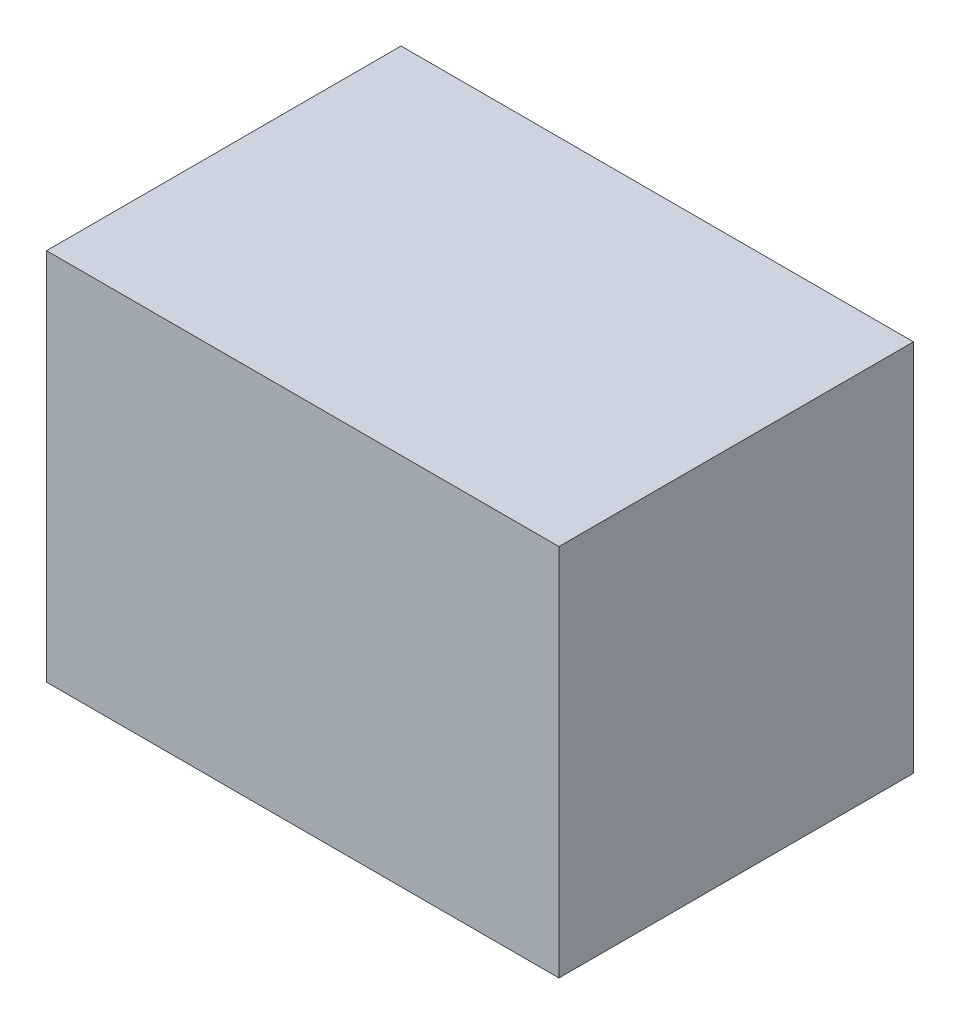
ISO-10303-21;
HEADER;
FILE_DESCRIPTION(('STEP AP214'),'2;1');
FILE_NAME('part.step','',(''),(''),'','','');
FILE_SCHEMA(('AUTOMOTIVE_DESIGN { 1 0 10303 214 1 1 1 1 }'));
ENDSEC;
DATA;
#1=APPLICATION_CONTEXT('core data for automotive mechanical design processes');
#2=APPLICATION_PROTOCOL_DEFINITION('international standard','automotive_design',2000,#1);
#3=PRODUCT_CONTEXT('',#1,'mechanical');
#4=PRODUCT('Part','Part','',(#3));
#5=PRODUCT_RELATED_PRODUCT_CATEGORY('part','',(#4));
#6=PRODUCT_DEFINITION_FORMATION('','',#4);
#7=PRODUCT_DEFINITION_CONTEXT('part definition',#1,'design');
#8=PRODUCT_DEFINITION('design','',#6,#7);
#9=PRODUCT_DEFINITION_SHAPE('','',#8);
#10=(LENGTH_UNIT() NAMED_UNIT(*) SI_UNIT(.MILLI.,.METRE.));
#11=(NAMED_UNIT(*) PLANE_ANGLE_UNIT() SI_UNIT($,.RADIAN.));
#12=(NAMED_UNIT(*) SI_UNIT($,.STERADIAN.) SOLID_ANGLE_UNIT());
#13=UNCERTAINTY_MEASURE_WITH_UNIT(LENGTH_MEASURE(1.E-05),#10,'distance_accuracy_value','');
#14=(GEOMETRIC_REPRESENTATION_CONTEXT(3) GLOBAL_UNCERTAINTY_ASSIGNED_CONTEXT((#13)) GLOBAL_UNIT_ASSIGNED_CONTEXT((#10,
#11,#12)) REPRESENTATION_CONTEXT('',''));
#15=CARTESIAN_POINT('',(0.,0.,0.));
#16=DIRECTION('',(0.,0.,1.));
#17=DIRECTION('',(1.,0.,0.));
#18=AXIS2_PLACEMENT_3D('',#15,#16,#17);
#19=CARTESIAN_POINT('',(24.,35.,16.6045));
#20=DIRECTION('',(-1.,0.,0.));
#21=DIRECTION('',(0.,0.,1.));
#22=AXIS2_PLACEMENT_3D('',#19,#20,#21);
#23=PLANE('',#22);
#24=DIRECTION('',(0.,0.,-1.));
#25=VECTOR('',#24,1.);
#26=CARTESIAN_POINT('',(24.,0.,16.6045));
#27=LINE('',#26,#25);
#28=CARTESIAN_POINT('',(24.,0.,16.6045));
#29=VERTEX_POINT('',#28);
#30=CARTESIAN_POINT('',(24.,0.,-16.6045));
#31=VERTEX_POINT('',#30);
#32=EDGE_CURVE('E106',#29,#31,#27,.T.);
#33=ORIENTED_EDGE('',*,*,#32,.T.);
#34=DIRECTION('',(0.,-1.,0.));
#35=VECTOR('',#34,1.);
#36=CARTESIAN_POINT('',(24.,35.,-16.6045));
#37=LINE('',#36,#35);
#38=CARTESIAN_POINT('',(24.,35.,-16.6045));
#39=VERTEX_POINT('',#38);
#40=EDGE_CURVE('E11',#39,#31,#37,.T.);
#41=ORIENTED_EDGE('',*,*,#40,.F.);
#42=DIRECTION('',(0.,0.,-1.));
#43=VECTOR('',#42,1.);
#44=CARTESIAN_POINT('',(24.,35.,16.6045));
#45=LINE('',#44,#43);
#46=CARTESIAN_POINT('',(24.,35.,16.6045));
#47=VERTEX_POINT('',#46);
#48=EDGE_CURVE('E90',#47,#39,#45,.T.);
#49=ORIENTED_EDGE('',*,*,#48,.F.);
#50=DIRECTION('',(0.,-1.,0.));
#51=VECTOR('',#50,1.);
#52=CARTESIAN_POINT('',(24.,35.,16.6045));
#53=LINE('',#52,#51);
#54=EDGE_CURVE('E102',#47,#29,#53,.T.);
#55=ORIENTED_EDGE('',*,*,#54,.T.);
#56=EDGE_LOOP('',(#33,#41,#49,#55));
#57=FACE_BOUND('',#56,.T.);
#58=ADVANCED_FACE('F38',(#57),#23,.F.);
#59=CARTESIAN_POINT('',(-24.,35.,-16.6045));
#60=DIRECTION('',(0.,0.,1.));
#61=DIRECTION('',(1.,0.,0.));
#62=AXIS2_PLACEMENT_3D('',#59,#60,#61);
#63=PLANE('',#62);
#64=DIRECTION('',(-1.,0.,0.));
#65=VECTOR('',#64,1.);
#66=CARTESIAN_POINT('',(-24.,0.,-16.6045));
#67=LINE('',#66,#65);
#68=CARTESIAN_POINT('',(-24.,0.,-16.6045));
#69=VERTEX_POINT('',#68);
#70=EDGE_CURVE('E95',#31,#69,#67,.T.);
#71=ORIENTED_EDGE('',*,*,#70,.T.);
#72=DIRECTION('',(0.,-1.,0.));
#73=VECTOR('',#72,1.);
#74=CARTESIAN_POINT('',(-24.,35.,-16.6045));
#75=LINE('',#74,#73);
#76=CARTESIAN_POINT('',(-24.,35.,-16.6045));
#77=VERTEX_POINT('',#76);
#78=EDGE_CURVE('E47',#77,#69,#75,.T.);
#79=ORIENTED_EDGE('',*,*,#78,.F.);
#80=DIRECTION('',(-1.,0.,0.));
#81=VECTOR('',#80,1.);
#82=CARTESIAN_POINT('',(-24.,35.,-16.6045));
#83=LINE('',#82,#81);
#84=EDGE_CURVE('E85',#39,#77,#83,.T.);
#85=ORIENTED_EDGE('',*,*,#84,.F.);
#86=ORIENTED_EDGE('',*,*,#40,.T.);
#87=EDGE_LOOP('',(#71,#79,#85,#86));
#88=FACE_BOUND('',#87,.T.);
#89=ADVANCED_FACE('F94',(#88),#63,.F.);
#90=CARTESIAN_POINT('',(-24.,35.,16.6045));
#91=DIRECTION('',(1.,0.,0.));
#92=DIRECTION('',(0.,0.,-1.));
#93=AXIS2_PLACEMENT_3D('',#90,#91,#92);
#94=PLANE('',#93);
#95=DIRECTION('',(0.,0.,1.));
#96=VECTOR('',#95,1.);
#97=CARTESIAN_POINT('',(-24.,0.,16.6045));
#98=LINE('',#97,#96);
#99=CARTESIAN_POINT('',(-24.,0.,16.6045));
#100=VERTEX_POINT('',#99);
#101=EDGE_CURVE('E72',#69,#100,#98,.T.);
#102=ORIENTED_EDGE('',*,*,#101,.T.);
#103=DIRECTION('',(0.,-1.,0.));
#104=VECTOR('',#103,1.);
#105=CARTESIAN_POINT('',(-24.,35.,16.6045));
#106=LINE('',#105,#104);
#107=CARTESIAN_POINT('',(-24.,35.,16.6045));
#108=VERTEX_POINT('',#107);
#109=EDGE_CURVE('E97',#108,#100,#106,.T.);
#110=ORIENTED_EDGE('',*,*,#109,.F.);
#111=DIRECTION('',(0.,0.,1.));
#112=VECTOR('',#111,1.);
#113=CARTESIAN_POINT('',(-24.,35.,16.6045));
#114=LINE('',#113,#112);
#115=EDGE_CURVE('E88',#77,#108,#114,.T.);
#116=ORIENTED_EDGE('',*,*,#115,.F.);
#117=ORIENTED_EDGE('',*,*,#78,.T.);
#118=EDGE_LOOP('',(#102,#110,#116,#117));
#119=FACE_BOUND('',#118,.T.);
#120=ADVANCED_FACE('F98',(#119),#94,.F.);
#121=CARTESIAN_POINT('',(-24.,35.,16.6045));
#122=DIRECTION('',(0.,0.,-1.));
#123=DIRECTION('',(-1.,0.,0.));
#124=AXIS2_PLACEMENT_3D('',#121,#122,#123);
#125=PLANE('',#124);
#126=DIRECTION('',(1.,0.,0.));
#127=VECTOR('',#126,1.);
#128=CARTESIAN_POINT('',(-24.,0.,16.6045));
#129=LINE('',#128,#127);
#130=EDGE_CURVE('E78',#100,#29,#129,.T.);
#131=ORIENTED_EDGE('',*,*,#130,.T.);
#132=ORIENTED_EDGE('',*,*,#54,.F.);
#133=DIRECTION('',(1.,0.,0.));
#134=VECTOR('',#133,1.);
#135=CARTESIAN_POINT('',(-24.,35.,16.6045));
#136=LINE('',#135,#134);
#137=EDGE_CURVE('E55',#108,#47,#136,.T.);
#138=ORIENTED_EDGE('',*,*,#137,.F.);
#139=ORIENTED_EDGE('',*,*,#109,.T.);
#140=EDGE_LOOP('',(#131,#132,#138,#139));
#141=FACE_BOUND('',#140,.T.);
#142=ADVANCED_FACE('F119',(#141),#125,.F.);
#143=CARTESIAN_POINT('',(0.,35.,0.));
#144=DIRECTION('',(0.,-1.,0.));
#145=DIRECTION('',(0.,0.,-1.));
#146=AXIS2_PLACEMENT_3D('',#143,#144,#145);
#147=PLANE('',#146);
#148=ORIENTED_EDGE('',*,*,#48,.T.);
#149=ORIENTED_EDGE('',*,*,#84,.T.);
#150=ORIENTED_EDGE('',*,*,#115,.T.);
#151=ORIENTED_EDGE('',*,*,#137,.T.);
#152=EDGE_LOOP('',(#148,#149,#150,#151));
#153=FACE_BOUND('',#152,.T.);
#154=ADVANCED_FACE('F86',(#153),#147,.F.);
#155=CARTESIAN_POINT('',(0.,0.,0.));
#156=DIRECTION('',(0.,-1.,0.));
#157=DIRECTION('',(0.,0.,-1.));
#158=AXIS2_PLACEMENT_3D('',#155,#156,#157);
#159=PLANE('',#158);
#160=ORIENTED_EDGE('',*,*,#32,.F.);
#161=ORIENTED_EDGE('',*,*,#130,.F.);
#162=ORIENTED_EDGE('',*,*,#101,.F.);
#163=ORIENTED_EDGE('',*,*,#70,.F.);
#164=EDGE_LOOP('',(#160,#161,#162,#163));
#165=FACE_BOUND('',#164,.T.);
#166=ADVANCED_FACE('F122',(#165),#159,.T.);
#167=CLOSED_SHELL('',(#58,#89,#120,#142,#154,#166));
#168=MANIFOLD_SOLID_BREP('B2',#167);
#169=ADVANCED_BREP_SHAPE_REPRESENTATION('',(#18,#168),#14);
#170=SHAPE_DEFINITION_REPRESENTATION(#9,#169);
ENDSEC;
END-ISO-10303-21;
